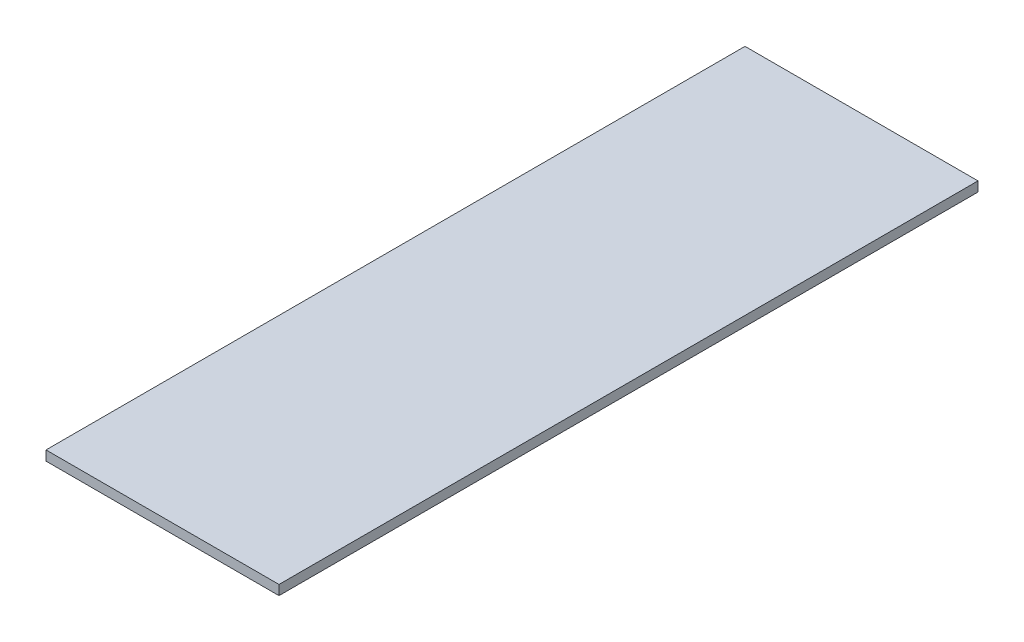
ISO-10303-21;
HEADER;
FILE_DESCRIPTION(('STEP AP214'),'2;1');
FILE_NAME('part.step','',(''),(''),'','','');
FILE_SCHEMA(('AUTOMOTIVE_DESIGN { 1 0 10303 214 1 1 1 1 }'));
ENDSEC;
DATA;
#1=APPLICATION_CONTEXT('core data for automotive mechanical design processes');
#2=APPLICATION_PROTOCOL_DEFINITION('international standard','automotive_design',2000,#1);
#3=PRODUCT_CONTEXT('',#1,'mechanical');
#4=PRODUCT('Part','Part','',(#3));
#5=PRODUCT_RELATED_PRODUCT_CATEGORY('part','',(#4));
#6=PRODUCT_DEFINITION_FORMATION('','',#4);
#7=PRODUCT_DEFINITION_CONTEXT('part definition',#1,'design');
#8=PRODUCT_DEFINITION('design','',#6,#7);
#9=PRODUCT_DEFINITION_SHAPE('','',#8);
#10=(LENGTH_UNIT() NAMED_UNIT(*) SI_UNIT(.MILLI.,.METRE.));
#11=(NAMED_UNIT(*) PLANE_ANGLE_UNIT() SI_UNIT($,.RADIAN.));
#12=(NAMED_UNIT(*) SI_UNIT($,.STERADIAN.) SOLID_ANGLE_UNIT());
#13=UNCERTAINTY_MEASURE_WITH_UNIT(LENGTH_MEASURE(1.E-05),#10,'distance_accuracy_value','');
#14=(GEOMETRIC_REPRESENTATION_CONTEXT(3) GLOBAL_UNCERTAINTY_ASSIGNED_CONTEXT((#13)) GLOBAL_UNIT_ASSIGNED_CONTEXT((#10,
#11,#12)) REPRESENTATION_CONTEXT('',''));
#15=CARTESIAN_POINT('',(0.,0.,0.));
#16=DIRECTION('',(0.,0.,1.));
#17=DIRECTION('',(1.,0.,0.));
#18=AXIS2_PLACEMENT_3D('',#15,#16,#17);
#19=CARTESIAN_POINT('',(152.4,6.35,457.2));
#20=DIRECTION('',(-1.,0.,0.));
#21=DIRECTION('',(0.,0.,1.));
#22=AXIS2_PLACEMENT_3D('',#19,#20,#21);
#23=PLANE('',#22);
#24=DIRECTION('',(0.,0.,-1.));
#25=VECTOR('',#24,1.);
#26=CARTESIAN_POINT('',(152.4,-6.35,457.2));
#27=LINE('',#26,#25);
#28=CARTESIAN_POINT('',(152.4,-6.35,457.2));
#29=VERTEX_POINT('',#28);
#30=CARTESIAN_POINT('',(152.4,-6.35,-457.2));
#31=VERTEX_POINT('',#30);
#32=EDGE_CURVE('E111',#29,#31,#27,.T.);
#33=ORIENTED_EDGE('',*,*,#32,.T.);
#34=DIRECTION('',(0.,-1.,0.));
#35=VECTOR('',#34,1.);
#36=CARTESIAN_POINT('',(152.4,6.35,-457.2));
#37=LINE('',#36,#35);
#38=CARTESIAN_POINT('',(152.4,6.35,-457.2));
#39=VERTEX_POINT('',#38);
#40=EDGE_CURVE('E11',#39,#31,#37,.T.);
#41=ORIENTED_EDGE('',*,*,#40,.F.);
#42=DIRECTION('',(0.,0.,-1.));
#43=VECTOR('',#42,1.);
#44=CARTESIAN_POINT('',(152.4,6.35,457.2));
#45=LINE('',#44,#43);
#46=CARTESIAN_POINT('',(152.4,6.35,457.2));
#47=VERTEX_POINT('',#46);
#48=EDGE_CURVE('E95',#47,#39,#45,.T.);
#49=ORIENTED_EDGE('',*,*,#48,.F.);
#50=DIRECTION('',(0.,-1.,0.));
#51=VECTOR('',#50,1.);
#52=CARTESIAN_POINT('',(152.4,6.35,457.2));
#53=LINE('',#52,#51);
#54=EDGE_CURVE('E107',#47,#29,#53,.T.);
#55=ORIENTED_EDGE('',*,*,#54,.T.);
#56=EDGE_LOOP('',(#33,#41,#49,#55));
#57=FACE_BOUND('',#56,.T.);
#58=ADVANCED_FACE('F43',(#57),#23,.F.);
#59=CARTESIAN_POINT('',(-152.4,6.35,-457.2));
#60=DIRECTION('',(0.,0.,1.));
#61=DIRECTION('',(1.,0.,0.));
#62=AXIS2_PLACEMENT_3D('',#59,#60,#61);
#63=PLANE('',#62);
#64=DIRECTION('',(-1.,0.,0.));
#65=VECTOR('',#64,1.);
#66=CARTESIAN_POINT('',(-152.4,-6.35,-457.2));
#67=LINE('',#66,#65);
#68=CARTESIAN_POINT('',(-152.4,-6.35,-457.2));
#69=VERTEX_POINT('',#68);
#70=EDGE_CURVE('E100',#31,#69,#67,.T.);
#71=ORIENTED_EDGE('',*,*,#70,.T.);
#72=DIRECTION('',(0.,-1.,0.));
#73=VECTOR('',#72,1.);
#74=CARTESIAN_POINT('',(-152.4,6.35,-457.2));
#75=LINE('',#74,#73);
#76=CARTESIAN_POINT('',(-152.4,6.35,-457.2));
#77=VERTEX_POINT('',#76);
#78=EDGE_CURVE('E52',#77,#69,#75,.T.);
#79=ORIENTED_EDGE('',*,*,#78,.F.);
#80=DIRECTION('',(-1.,0.,0.));
#81=VECTOR('',#80,1.);
#82=CARTESIAN_POINT('',(-152.4,6.35,-457.2));
#83=LINE('',#82,#81);
#84=EDGE_CURVE('E90',#39,#77,#83,.T.);
#85=ORIENTED_EDGE('',*,*,#84,.F.);
#86=ORIENTED_EDGE('',*,*,#40,.T.);
#87=EDGE_LOOP('',(#71,#79,#85,#86));
#88=FACE_BOUND('',#87,.T.);
#89=ADVANCED_FACE('F99',(#88),#63,.F.);
#90=CARTESIAN_POINT('',(-152.4,6.35,457.2));
#91=DIRECTION('',(1.,0.,0.));
#92=DIRECTION('',(0.,0.,-1.));
#93=AXIS2_PLACEMENT_3D('',#90,#91,#92);
#94=PLANE('',#93);
#95=DIRECTION('',(0.,0.,1.));
#96=VECTOR('',#95,1.);
#97=CARTESIAN_POINT('',(-152.4,-6.35,457.2));
#98=LINE('',#97,#96);
#99=CARTESIAN_POINT('',(-152.4,-6.35,457.2));
#100=VERTEX_POINT('',#99);
#101=EDGE_CURVE('E77',#69,#100,#98,.T.);
#102=ORIENTED_EDGE('',*,*,#101,.T.);
#103=DIRECTION('',(0.,-1.,0.));
#104=VECTOR('',#103,1.);
#105=CARTESIAN_POINT('',(-152.4,6.35,457.2));
#106=LINE('',#105,#104);
#107=CARTESIAN_POINT('',(-152.4,6.35,457.2));
#108=VERTEX_POINT('',#107);
#109=EDGE_CURVE('E102',#108,#100,#106,.T.);
#110=ORIENTED_EDGE('',*,*,#109,.F.);
#111=DIRECTION('',(0.,0.,1.));
#112=VECTOR('',#111,1.);
#113=CARTESIAN_POINT('',(-152.4,6.35,457.2));
#114=LINE('',#113,#112);
#115=EDGE_CURVE('E93',#77,#108,#114,.T.);
#116=ORIENTED_EDGE('',*,*,#115,.F.);
#117=ORIENTED_EDGE('',*,*,#78,.T.);
#118=EDGE_LOOP('',(#102,#110,#116,#117));
#119=FACE_BOUND('',#118,.T.);
#120=ADVANCED_FACE('F103',(#119),#94,.F.);
#121=CARTESIAN_POINT('',(-152.4,6.35,457.2));
#122=DIRECTION('',(0.,0.,-1.));
#123=DIRECTION('',(-1.,0.,0.));
#124=AXIS2_PLACEMENT_3D('',#121,#122,#123);
#125=PLANE('',#124);
#126=DIRECTION('',(1.,0.,0.));
#127=VECTOR('',#126,1.);
#128=CARTESIAN_POINT('',(-152.4,-6.35,457.2));
#129=LINE('',#128,#127);
#130=EDGE_CURVE('E83',#100,#29,#129,.T.);
#131=ORIENTED_EDGE('',*,*,#130,.T.);
#132=ORIENTED_EDGE('',*,*,#54,.F.);
#133=DIRECTION('',(1.,0.,0.));
#134=VECTOR('',#133,1.);
#135=CARTESIAN_POINT('',(-152.4,6.35,457.2));
#136=LINE('',#135,#134);
#137=EDGE_CURVE('E60',#108,#47,#136,.T.);
#138=ORIENTED_EDGE('',*,*,#137,.F.);
#139=ORIENTED_EDGE('',*,*,#109,.T.);
#140=EDGE_LOOP('',(#131,#132,#138,#139));
#141=FACE_BOUND('',#140,.T.);
#142=ADVANCED_FACE('F124',(#141),#125,.F.);
#143=CARTESIAN_POINT('',(0.,6.35,0.));
#144=DIRECTION('',(0.,-1.,0.));
#145=DIRECTION('',(0.,0.,-1.));
#146=AXIS2_PLACEMENT_3D('',#143,#144,#145);
#147=PLANE('',#146);
#148=ORIENTED_EDGE('',*,*,#48,.T.);
#149=ORIENTED_EDGE('',*,*,#84,.T.);
#150=ORIENTED_EDGE('',*,*,#115,.T.);
#151=ORIENTED_EDGE('',*,*,#137,.T.);
#152=EDGE_LOOP('',(#148,#149,#150,#151));
#153=FACE_BOUND('',#152,.T.);
#154=ADVANCED_FACE('F91',(#153),#147,.F.);
#155=CARTESIAN_POINT('',(0.,-6.35,0.));
#156=DIRECTION('',(0.,-1.,0.));
#157=DIRECTION('',(0.,0.,-1.));
#158=AXIS2_PLACEMENT_3D('',#155,#156,#157);
#159=PLANE('',#158);
#160=ORIENTED_EDGE('',*,*,#32,.F.);
#161=ORIENTED_EDGE('',*,*,#130,.F.);
#162=ORIENTED_EDGE('',*,*,#101,.F.);
#163=ORIENTED_EDGE('',*,*,#70,.F.);
#164=EDGE_LOOP('',(#160,#161,#162,#163));
#165=FACE_BOUND('',#164,.T.);
#166=ADVANCED_FACE('F127',(#165),#159,.T.);
#167=CLOSED_SHELL('',(#58,#89,#120,#142,#154,#166));
#168=MANIFOLD_SOLID_BREP('B2',#167);
#169=ADVANCED_BREP_SHAPE_REPRESENTATION('',(#18,#168),#14);
#170=SHAPE_DEFINITION_REPRESENTATION(#9,#169);
ENDSEC;
END-ISO-10303-21;
